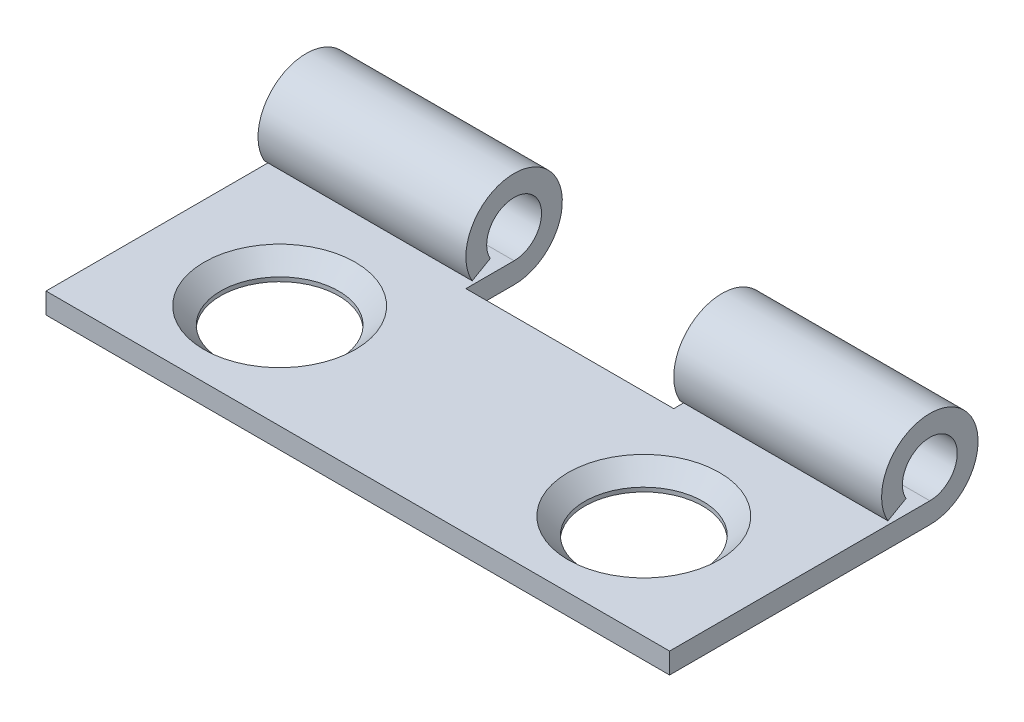
ISO-10303-21;
HEADER;
FILE_DESCRIPTION(('STEP AP214'),'2;1');
FILE_NAME('part.step','',(''),(''),'','','');
FILE_SCHEMA(('AUTOMOTIVE_DESIGN { 1 0 10303 214 1 1 1 1 }'));
ENDSEC;
DATA;
#1=APPLICATION_CONTEXT('core data for automotive mechanical design processes');
#2=APPLICATION_PROTOCOL_DEFINITION('international standard','automotive_design',2000,#1);
#3=PRODUCT_CONTEXT('',#1,'mechanical');
#4=PRODUCT('Part','Part','',(#3));
#5=PRODUCT_RELATED_PRODUCT_CATEGORY('part','',(#4));
#6=PRODUCT_DEFINITION_FORMATION('','',#4);
#7=PRODUCT_DEFINITION_CONTEXT('part definition',#1,'design');
#8=PRODUCT_DEFINITION('design','',#6,#7);
#9=PRODUCT_DEFINITION_SHAPE('','',#8);
#10=(LENGTH_UNIT() NAMED_UNIT(*) SI_UNIT(.MILLI.,.METRE.));
#11=(NAMED_UNIT(*) PLANE_ANGLE_UNIT() SI_UNIT($,.RADIAN.));
#12=(NAMED_UNIT(*) SI_UNIT($,.STERADIAN.) SOLID_ANGLE_UNIT());
#13=UNCERTAINTY_MEASURE_WITH_UNIT(LENGTH_MEASURE(1.E-05),#10,'distance_accuracy_value','');
#14=(GEOMETRIC_REPRESENTATION_CONTEXT(3) GLOBAL_UNCERTAINTY_ASSIGNED_CONTEXT((#13)) GLOBAL_UNIT_ASSIGNED_CONTEXT((#10,
#11,#12)) REPRESENTATION_CONTEXT('',''));
#15=CARTESIAN_POINT('',(0.,0.,0.));
#16=DIRECTION('',(0.,0.,1.));
#17=DIRECTION('',(1.,0.,0.));
#18=AXIS2_PLACEMENT_3D('',#15,#16,#17);
#19=CARTESIAN_POINT('',(9.525,0.,0.));
#20=DIRECTION('',(-1.,0.,0.));
#21=DIRECTION('',(0.,0.,1.));
#22=AXIS2_PLACEMENT_3D('',#19,#20,#21);
#23=CYLINDRICAL_SURFACE('',#22,0.8382);
#24=DIRECTION('',(-1.,0.,0.));
#25=VECTOR('',#24,1.);
#26=CARTESIAN_POINT('',(9.525,-0.414510225725591,0.728533124002553));
#27=LINE('',#26,#25);
#28=CARTESIAN_POINT('',(9.525,-0.414510225725591,0.728533124002553));
#29=VERTEX_POINT('',#28);
#30=CARTESIAN_POINT('',(3.175,-0.414510225725591,0.728533124002553));
#31=VERTEX_POINT('',#30);
#32=EDGE_CURVE('E156',#29,#31,#27,.T.);
#33=ORIENTED_EDGE('',*,*,#32,.T.);
#34=CARTESIAN_POINT('',(3.175,0.,0.));
#35=DIRECTION('',(1.,0.,0.));
#36=DIRECTION('',(0.,0.,-1.));
#37=AXIS2_PLACEMENT_3D('',#34,#35,#36);
#38=CIRCLE('',#37,0.8382);
#39=CARTESIAN_POINT('',(3.175,-0.8382,0.));
#40=VERTEX_POINT('',#39);
#41=EDGE_CURVE('E206',#31,#40,#38,.F.);
#42=ORIENTED_EDGE('',*,*,#41,.T.);
#43=DIRECTION('',(-1.,0.,0.));
#44=VECTOR('',#43,1.);
#45=CARTESIAN_POINT('',(9.525,-0.8382,0.));
#46=LINE('',#45,#44);
#47=CARTESIAN_POINT('',(9.525,-0.8382,0.));
#48=VERTEX_POINT('',#47);
#49=EDGE_CURVE('E166',#48,#40,#46,.T.);
#50=ORIENTED_EDGE('',*,*,#49,.F.);
#51=CARTESIAN_POINT('',(9.525,0.,0.));
#52=DIRECTION('',(-1.,0.,0.));
#53=DIRECTION('',(0.,0.,1.));
#54=AXIS2_PLACEMENT_3D('',#51,#52,#53);
#55=CIRCLE('',#54,0.8382);
#56=EDGE_CURVE('E155',#29,#48,#55,.T.);
#57=ORIENTED_EDGE('',*,*,#56,.F.);
#58=EDGE_LOOP('',(#33,#42,#50,#57));
#59=FACE_BOUND('',#58,.T.);
#60=ADVANCED_FACE('F36',(#59),#23,.F.);
#61=CARTESIAN_POINT('',(9.525,0.,0.));
#62=DIRECTION('',(-1.,0.,0.));
#63=DIRECTION('',(0.,0.,1.));
#64=AXIS2_PLACEMENT_3D('',#61,#62,#63);
#65=CYLINDRICAL_SURFACE('',#64,1.47320000000008);
#66=CARTESIAN_POINT('',(3.175,0.,0.));
#67=DIRECTION('',(1.,0.,0.));
#68=DIRECTION('',(0.,0.,-1.));
#69=AXIS2_PLACEMENT_3D('',#66,#67,#68);
#70=CIRCLE('',#69,1.47320000000008);
#71=CARTESIAN_POINT('',(3.175,-1.4732,0.));
#72=VERTEX_POINT('',#71);
#73=CARTESIAN_POINT('',(3.175,-0.728533124002552,1.28045215733782));
#74=VERTEX_POINT('',#73);
#75=EDGE_CURVE('E207',#72,#74,#70,.T.);
#76=ORIENTED_EDGE('',*,*,#75,.T.);
#77=DIRECTION('',(-1.,0.,0.));
#78=VECTOR('',#77,1.);
#79=CARTESIAN_POINT('',(9.525,-0.728533124002553,1.28045215733782));
#80=LINE('',#79,#78);
#81=CARTESIAN_POINT('',(9.525,-0.728533124002553,1.28045215733782));
#82=VERTEX_POINT('',#81);
#83=EDGE_CURVE('E135',#82,#74,#80,.T.);
#84=ORIENTED_EDGE('',*,*,#83,.F.);
#85=CARTESIAN_POINT('',(9.525,0.,0.));
#86=DIRECTION('',(1.,0.,0.));
#87=DIRECTION('',(0.,0.,1.));
#88=AXIS2_PLACEMENT_3D('',#85,#86,#87);
#89=CIRCLE('',#88,1.47320000000008);
#90=CARTESIAN_POINT('',(9.525,-1.4732,0.));
#91=VERTEX_POINT('',#90);
#92=EDGE_CURVE('E112',#91,#82,#89,.T.);
#93=ORIENTED_EDGE('',*,*,#92,.F.);
#94=DIRECTION('',(-1.,0.,0.));
#95=VECTOR('',#94,1.);
#96=CARTESIAN_POINT('',(9.525,-1.4732,0.));
#97=LINE('',#96,#95);
#98=EDGE_CURVE('E122',#91,#72,#97,.T.);
#99=ORIENTED_EDGE('',*,*,#98,.T.);
#100=EDGE_LOOP('',(#76,#84,#93,#99));
#101=FACE_BOUND('',#100,.T.);
#102=ADVANCED_FACE('F133',(#101),#65,.T.);
#103=CARTESIAN_POINT('',(9.525,-0.414510225725591,0.728533124002553));
#104=DIRECTION('',(0.,0.869163832024043,0.49452424925506));
#105=DIRECTION('',(0.,-0.49452424925506,0.869163832024043));
#106=AXIS2_PLACEMENT_3D('',#103,#104,#105);
#107=PLANE('',#106);
#108=ORIENTED_EDGE('',*,*,#83,.T.);
#109=DIRECTION('',(0.,0.49452424925506,-0.869163832024043));
#110=VECTOR('',#109,1.);
#111=CARTESIAN_POINT('',(3.175,-0.414510225725591,0.728533124002554));
#112=LINE('',#111,#110);
#113=EDGE_CURVE('E11',#74,#31,#112,.T.);
#114=ORIENTED_EDGE('',*,*,#113,.T.);
#115=ORIENTED_EDGE('',*,*,#32,.F.);
#116=DIRECTION('',(0.,0.49452424925506,-0.869163832024043));
#117=VECTOR('',#116,1.);
#118=CARTESIAN_POINT('',(9.525,-0.414510225725591,0.728533124002553));
#119=LINE('',#118,#117);
#120=EDGE_CURVE('E62',#82,#29,#119,.T.);
#121=ORIENTED_EDGE('',*,*,#120,.F.);
#122=EDGE_LOOP('',(#108,#114,#115,#121));
#123=FACE_BOUND('',#122,.T.);
#124=ADVANCED_FACE('F263',(#123),#107,.F.);
#125=CARTESIAN_POINT('',(-3.175,-0.8382,0.));
#126=VERTEX_POINT('',#125);
#127=CARTESIAN_POINT('',(-9.525,-0.8382,0.));
#128=VERTEX_POINT('',#127);
#129=EDGE_CURVE('E165',#126,#128,#46,.T.);
#130=ORIENTED_EDGE('',*,*,#129,.F.);
#131=CARTESIAN_POINT('',(-3.175,0.,0.));
#132=DIRECTION('',(-1.,0.,0.));
#133=DIRECTION('',(0.,0.,1.));
#134=AXIS2_PLACEMENT_3D('',#131,#132,#133);
#135=CIRCLE('',#134,0.8382);
#136=CARTESIAN_POINT('',(-3.175,-0.414510225725591,0.728533124002553));
#137=VERTEX_POINT('',#136);
#138=EDGE_CURVE('E198',#126,#137,#135,.F.);
#139=ORIENTED_EDGE('',*,*,#138,.T.);
#140=CARTESIAN_POINT('',(-9.525,-0.414510225725591,0.728533124002553));
#141=VERTEX_POINT('',#140);
#142=EDGE_CURVE('E90',#137,#141,#27,.T.);
#143=ORIENTED_EDGE('',*,*,#142,.T.);
#144=CARTESIAN_POINT('',(-9.525,0.,0.));
#145=DIRECTION('',(-1.,0.,0.));
#146=DIRECTION('',(0.,0.,1.));
#147=AXIS2_PLACEMENT_3D('',#144,#145,#146);
#148=CIRCLE('',#147,0.8382);
#149=EDGE_CURVE('E140',#141,#128,#148,.T.);
#150=ORIENTED_EDGE('',*,*,#149,.T.);
#151=EDGE_LOOP('',(#130,#139,#143,#150));
#152=FACE_BOUND('',#151,.T.);
#153=ADVANCED_FACE('F38',(#152),#23,.F.);
#154=CARTESIAN_POINT('',(9.525,-0.8382,7.9502));
#155=DIRECTION('',(0.,-1.,0.));
#156=DIRECTION('',(0.,0.,-1.));
#157=AXIS2_PLACEMENT_3D('',#154,#155,#156);
#158=PLANE('',#157);
#159=CARTESIAN_POINT('',(5.5626,-0.8382,4.7752));
#160=DIRECTION('',(0.,1.,0.));
#161=DIRECTION('',(0.,0.,1.));
#162=AXIS2_PLACEMENT_3D('',#159,#160,#161);
#163=CIRCLE('',#162,2.3114);
#164=CARTESIAN_POINT('',(5.5626,-0.8382,7.0866));
#165=VERTEX_POINT('',#164);
#166=EDGE_CURVE('E183',#165,#165,#163,.T.);
#167=ORIENTED_EDGE('',*,*,#166,.F.);
#168=EDGE_LOOP('',(#167));
#169=FACE_BOUND('',#168,.T.);
#170=CARTESIAN_POINT('',(-5.5626,-0.8382,4.7752));
#171=DIRECTION('',(0.,1.,0.));
#172=DIRECTION('',(0.,0.,1.));
#173=AXIS2_PLACEMENT_3D('',#170,#171,#172);
#174=CIRCLE('',#173,2.3114);
#175=CARTESIAN_POINT('',(-5.5626,-0.8382,7.0866));
#176=VERTEX_POINT('',#175);
#177=EDGE_CURVE('E174',#176,#176,#174,.T.);
#178=ORIENTED_EDGE('',*,*,#177,.F.);
#179=EDGE_LOOP('',(#178));
#180=FACE_BOUND('',#179,.T.);
#181=ORIENTED_EDGE('',*,*,#49,.T.);
#182=DIRECTION('',(0.,0.,1.));
#183=VECTOR('',#182,1.);
#184=CARTESIAN_POINT('',(3.175,-0.8382,7.9502));
#185=LINE('',#184,#183);
#186=CARTESIAN_POINT('',(3.175,-0.8382,1.47320000000012));
#187=VERTEX_POINT('',#186);
#188=EDGE_CURVE('E209',#40,#187,#185,.T.);
#189=ORIENTED_EDGE('',*,*,#188,.T.);
#190=DIRECTION('',(-1.,0.,0.));
#191=VECTOR('',#190,1.);
#192=CARTESIAN_POINT('',(9.525,-0.8382,1.47320000000012));
#193=LINE('',#192,#191);
#194=CARTESIAN_POINT('',(-3.175,-0.8382,1.47320000000012));
#195=VERTEX_POINT('',#194);
#196=EDGE_CURVE('E143',#187,#195,#193,.T.);
#197=ORIENTED_EDGE('',*,*,#196,.T.);
#198=DIRECTION('',(0.,0.,-1.));
#199=VECTOR('',#198,1.);
#200=CARTESIAN_POINT('',(-3.175,-0.8382,7.9502));
#201=LINE('',#200,#199);
#202=EDGE_CURVE('E202',#195,#126,#201,.T.);
#203=ORIENTED_EDGE('',*,*,#202,.T.);
#204=ORIENTED_EDGE('',*,*,#129,.T.);
#205=DIRECTION('',(0.,0.,1.));
#206=VECTOR('',#205,1.);
#207=CARTESIAN_POINT('',(-9.525,-0.8382,7.9502));
#208=LINE('',#207,#206);
#209=CARTESIAN_POINT('',(-9.525,-0.8382,7.9502));
#210=VERTEX_POINT('',#209);
#211=EDGE_CURVE('E142',#128,#210,#208,.T.);
#212=ORIENTED_EDGE('',*,*,#211,.T.);
#213=DIRECTION('',(-1.,0.,0.));
#214=VECTOR('',#213,1.);
#215=CARTESIAN_POINT('',(9.525,-0.8382,7.9502));
#216=LINE('',#215,#214);
#217=CARTESIAN_POINT('',(9.525,-0.8382,7.9502));
#218=VERTEX_POINT('',#217);
#219=EDGE_CURVE('E162',#218,#210,#216,.T.);
#220=ORIENTED_EDGE('',*,*,#219,.F.);
#221=DIRECTION('',(0.,0.,1.));
#222=VECTOR('',#221,1.);
#223=CARTESIAN_POINT('',(9.525,-0.8382,7.9502));
#224=LINE('',#223,#222);
#225=EDGE_CURVE('E99',#48,#218,#224,.T.);
#226=ORIENTED_EDGE('',*,*,#225,.F.);
#227=EDGE_LOOP('',(#181,#189,#197,#203,#204,#212,#220,#226));
#228=FACE_BOUND('',#227,.T.);
#229=ADVANCED_FACE('F219',(#169,#180,#228),#158,.F.);
#230=CARTESIAN_POINT('',(9.525,-1.4732,7.9502));
#231=DIRECTION('',(0.,0.,-1.));
#232=DIRECTION('',(-1.,0.,0.));
#233=AXIS2_PLACEMENT_3D('',#230,#231,#232);
#234=PLANE('',#233);
#235=DIRECTION('',(0.,-1.,0.));
#236=VECTOR('',#235,1.);
#237=CARTESIAN_POINT('',(-9.525,-1.4732,7.9502));
#238=LINE('',#237,#236);
#239=CARTESIAN_POINT('',(-9.525,-1.4732,7.9502));
#240=VERTEX_POINT('',#239);
#241=EDGE_CURVE('E145',#210,#240,#238,.T.);
#242=ORIENTED_EDGE('',*,*,#241,.T.);
#243=DIRECTION('',(-1.,0.,0.));
#244=VECTOR('',#243,1.);
#245=CARTESIAN_POINT('',(9.525,-1.4732,7.9502));
#246=LINE('',#245,#244);
#247=CARTESIAN_POINT('',(9.525,-1.4732,7.9502));
#248=VERTEX_POINT('',#247);
#249=EDGE_CURVE('E130',#248,#240,#246,.T.);
#250=ORIENTED_EDGE('',*,*,#249,.F.);
#251=DIRECTION('',(0.,-1.,0.));
#252=VECTOR('',#251,1.);
#253=CARTESIAN_POINT('',(9.525,-1.4732,7.9502));
#254=LINE('',#253,#252);
#255=EDGE_CURVE('E115',#218,#248,#254,.T.);
#256=ORIENTED_EDGE('',*,*,#255,.F.);
#257=ORIENTED_EDGE('',*,*,#219,.T.);
#258=EDGE_LOOP('',(#242,#250,#256,#257));
#259=FACE_BOUND('',#258,.T.);
#260=ADVANCED_FACE('F223',(#259),#234,.F.);
#261=CARTESIAN_POINT('',(9.525,-1.4732,0.));
#262=DIRECTION('',(0.,1.,0.));
#263=DIRECTION('',(0.,0.,1.));
#264=AXIS2_PLACEMENT_3D('',#261,#262,#263);
#265=PLANE('',#264);
#266=CARTESIAN_POINT('',(5.5626,-1.4732,4.7752));
#267=DIRECTION('',(0.,1.,0.));
#268=DIRECTION('',(0.,0.,1.));
#269=AXIS2_PLACEMENT_3D('',#266,#267,#268);
#270=CIRCLE('',#269,1.8034);
#271=CARTESIAN_POINT('',(5.5626,-1.4732,6.5786));
#272=VERTEX_POINT('',#271);
#273=EDGE_CURVE('E170',#272,#272,#270,.T.);
#274=ORIENTED_EDGE('',*,*,#273,.T.);
#275=EDGE_LOOP('',(#274));
#276=FACE_BOUND('',#275,.T.);
#277=CARTESIAN_POINT('',(-5.5626,-1.4732,4.7752));
#278=DIRECTION('',(0.,1.,0.));
#279=DIRECTION('',(0.,0.,1.));
#280=AXIS2_PLACEMENT_3D('',#277,#278,#279);
#281=CIRCLE('',#280,1.8034);
#282=CARTESIAN_POINT('',(-5.5626,-1.4732,6.5786));
#283=VERTEX_POINT('',#282);
#284=EDGE_CURVE('E176',#283,#283,#281,.T.);
#285=ORIENTED_EDGE('',*,*,#284,.T.);
#286=EDGE_LOOP('',(#285));
#287=FACE_BOUND('',#286,.T.);
#288=DIRECTION('',(1.,0.,0.));
#289=VECTOR('',#288,1.);
#290=CARTESIAN_POINT('',(3.175,-1.4732,1.47320000000012));
#291=LINE('',#290,#289);
#292=CARTESIAN_POINT('',(-3.175,-1.4732,1.47320000000012));
#293=VERTEX_POINT('',#292);
#294=CARTESIAN_POINT('',(3.175,-1.4732,1.47320000000012));
#295=VERTEX_POINT('',#294);
#296=EDGE_CURVE('E192',#293,#295,#291,.T.);
#297=ORIENTED_EDGE('',*,*,#296,.T.);
#298=DIRECTION('',(0.,0.,-1.));
#299=VECTOR('',#298,1.);
#300=CARTESIAN_POINT('',(3.175,-1.4732,-1.47320000000013));
#301=LINE('',#300,#299);
#302=EDGE_CURVE('E127',#295,#72,#301,.T.);
#303=ORIENTED_EDGE('',*,*,#302,.T.);
#304=ORIENTED_EDGE('',*,*,#98,.F.);
#305=DIRECTION('',(0.,0.,-1.));
#306=VECTOR('',#305,1.);
#307=CARTESIAN_POINT('',(9.525,-1.4732,0.));
#308=LINE('',#307,#306);
#309=EDGE_CURVE('E108',#248,#91,#308,.T.);
#310=ORIENTED_EDGE('',*,*,#309,.F.);
#311=ORIENTED_EDGE('',*,*,#249,.T.);
#312=DIRECTION('',(0.,0.,-1.));
#313=VECTOR('',#312,1.);
#314=CARTESIAN_POINT('',(-9.525,-1.4732,0.));
#315=LINE('',#314,#313);
#316=CARTESIAN_POINT('',(-9.525,-1.4732,0.));
#317=VERTEX_POINT('',#316);
#318=EDGE_CURVE('E147',#240,#317,#315,.T.);
#319=ORIENTED_EDGE('',*,*,#318,.T.);
#320=CARTESIAN_POINT('',(-3.175,-1.4732,0.));
#321=VERTEX_POINT('',#320);
#322=EDGE_CURVE('E131',#321,#317,#97,.T.);
#323=ORIENTED_EDGE('',*,*,#322,.F.);
#324=DIRECTION('',(0.,0.,1.));
#325=VECTOR('',#324,1.);
#326=CARTESIAN_POINT('',(-3.175,-1.4732,1.47320000000012));
#327=LINE('',#326,#325);
#328=EDGE_CURVE('E189',#321,#293,#327,.T.);
#329=ORIENTED_EDGE('',*,*,#328,.T.);
#330=EDGE_LOOP('',(#297,#303,#304,#310,#311,#319,#323,#329));
#331=FACE_BOUND('',#330,.T.);
#332=ADVANCED_FACE('F124',(#276,#287,#331),#265,.F.);
#333=CARTESIAN_POINT('',(-3.175,-0.728533124002553,1.28045215733782));
#334=VERTEX_POINT('',#333);
#335=CARTESIAN_POINT('',(-9.525,-0.728533124002553,1.28045215733782));
#336=VERTEX_POINT('',#335);
#337=EDGE_CURVE('E159',#334,#336,#80,.T.);
#338=ORIENTED_EDGE('',*,*,#337,.F.);
#339=CARTESIAN_POINT('',(-3.175,0.,0.));
#340=DIRECTION('',(-1.,0.,0.));
#341=DIRECTION('',(0.,0.,1.));
#342=AXIS2_PLACEMENT_3D('',#339,#340,#341);
#343=CIRCLE('',#342,1.47320000000008);
#344=EDGE_CURVE('E53',#334,#321,#343,.T.);
#345=ORIENTED_EDGE('',*,*,#344,.T.);
#346=ORIENTED_EDGE('',*,*,#322,.T.);
#347=CARTESIAN_POINT('',(-9.525,0.,0.));
#348=DIRECTION('',(1.,0.,0.));
#349=DIRECTION('',(0.,0.,1.));
#350=AXIS2_PLACEMENT_3D('',#347,#348,#349);
#351=CIRCLE('',#350,1.47320000000008);
#352=EDGE_CURVE('E150',#317,#336,#351,.T.);
#353=ORIENTED_EDGE('',*,*,#352,.T.);
#354=EDGE_LOOP('',(#338,#345,#346,#353));
#355=FACE_BOUND('',#354,.T.);
#356=ADVANCED_FACE('F233',(#355),#65,.T.);
#357=ORIENTED_EDGE('',*,*,#142,.F.);
#358=DIRECTION('',(0.,-0.49452424925506,0.869163832024043));
#359=VECTOR('',#358,1.);
#360=CARTESIAN_POINT('',(-3.175,-0.414510225725592,0.728533124002554));
#361=LINE('',#360,#359);
#362=EDGE_CURVE('E45',#137,#334,#361,.T.);
#363=ORIENTED_EDGE('',*,*,#362,.T.);
#364=ORIENTED_EDGE('',*,*,#337,.T.);
#365=DIRECTION('',(0.,0.49452424925506,-0.869163832024043));
#366=VECTOR('',#365,1.);
#367=CARTESIAN_POINT('',(-9.525,-0.414510225725591,0.728533124002553));
#368=LINE('',#367,#366);
#369=EDGE_CURVE('E153',#336,#141,#368,.T.);
#370=ORIENTED_EDGE('',*,*,#369,.T.);
#371=EDGE_LOOP('',(#357,#363,#364,#370));
#372=FACE_BOUND('',#371,.T.);
#373=ADVANCED_FACE('F272',(#372),#107,.F.);
#374=CARTESIAN_POINT('',(9.525,0.,0.));
#375=DIRECTION('',(-1.,0.,0.));
#376=DIRECTION('',(0.,0.,1.));
#377=AXIS2_PLACEMENT_3D('',#374,#375,#376);
#378=PLANE('',#377);
#379=ORIENTED_EDGE('',*,*,#56,.T.);
#380=ORIENTED_EDGE('',*,*,#225,.T.);
#381=ORIENTED_EDGE('',*,*,#255,.T.);
#382=ORIENTED_EDGE('',*,*,#309,.T.);
#383=ORIENTED_EDGE('',*,*,#92,.T.);
#384=ORIENTED_EDGE('',*,*,#120,.T.);
#385=EDGE_LOOP('',(#379,#380,#381,#382,#383,#384));
#386=FACE_BOUND('',#385,.T.);
#387=ADVANCED_FACE('F110',(#386),#378,.F.);
#388=CARTESIAN_POINT('',(-9.525,0.,0.));
#389=DIRECTION('',(-1.,0.,0.));
#390=DIRECTION('',(0.,0.,1.));
#391=AXIS2_PLACEMENT_3D('',#388,#389,#390);
#392=PLANE('',#391);
#393=ORIENTED_EDGE('',*,*,#149,.F.);
#394=ORIENTED_EDGE('',*,*,#369,.F.);
#395=ORIENTED_EDGE('',*,*,#352,.F.);
#396=ORIENTED_EDGE('',*,*,#318,.F.);
#397=ORIENTED_EDGE('',*,*,#241,.F.);
#398=ORIENTED_EDGE('',*,*,#211,.F.);
#399=EDGE_LOOP('',(#393,#394,#395,#396,#397,#398));
#400=FACE_BOUND('',#399,.T.);
#401=ADVANCED_FACE('F229',(#400),#392,.T.);
#402=CARTESIAN_POINT('',(3.175,-1.4732,1.47320000000012));
#403=DIRECTION('',(0.,0.,1.));
#404=DIRECTION('',(1.,0.,0.));
#405=AXIS2_PLACEMENT_3D('',#402,#403,#404);
#406=PLANE('',#405);
#407=DIRECTION('',(0.,1.,0.));
#408=VECTOR('',#407,1.);
#409=CARTESIAN_POINT('',(3.175,-1.4732,1.47320000000012));
#410=LINE('',#409,#408);
#411=EDGE_CURVE('E195',#295,#187,#410,.T.);
#412=ORIENTED_EDGE('',*,*,#411,.F.);
#413=ORIENTED_EDGE('',*,*,#296,.F.);
#414=DIRECTION('',(0.,1.,0.));
#415=VECTOR('',#414,1.);
#416=CARTESIAN_POINT('',(-3.175,-1.4732,1.47320000000012));
#417=LINE('',#416,#415);
#418=EDGE_CURVE('E194',#293,#195,#417,.T.);
#419=ORIENTED_EDGE('',*,*,#418,.T.);
#420=ORIENTED_EDGE('',*,*,#196,.F.);
#421=EDGE_LOOP('',(#412,#413,#419,#420));
#422=FACE_BOUND('',#421,.T.);
#423=ADVANCED_FACE('F266',(#422),#406,.F.);
#424=CARTESIAN_POINT('',(3.175,-1.4732,-1.47320000000013));
#425=DIRECTION('',(1.,0.,0.));
#426=DIRECTION('',(0.,0.,-1.));
#427=AXIS2_PLACEMENT_3D('',#424,#425,#426);
#428=PLANE('',#427);
#429=ORIENTED_EDGE('',*,*,#41,.F.);
#430=ORIENTED_EDGE('',*,*,#113,.F.);
#431=ORIENTED_EDGE('',*,*,#75,.F.);
#432=ORIENTED_EDGE('',*,*,#302,.F.);
#433=ORIENTED_EDGE('',*,*,#411,.T.);
#434=ORIENTED_EDGE('',*,*,#188,.F.);
#435=EDGE_LOOP('',(#429,#430,#431,#432,#433,#434));
#436=FACE_BOUND('',#435,.T.);
#437=ADVANCED_FACE('F259',(#436),#428,.F.);
#438=CARTESIAN_POINT('',(-3.175,-1.4732,1.47320000000012));
#439=DIRECTION('',(-1.,0.,0.));
#440=DIRECTION('',(0.,0.,1.));
#441=AXIS2_PLACEMENT_3D('',#438,#439,#440);
#442=PLANE('',#441);
#443=ORIENTED_EDGE('',*,*,#344,.F.);
#444=ORIENTED_EDGE('',*,*,#362,.F.);
#445=ORIENTED_EDGE('',*,*,#138,.F.);
#446=ORIENTED_EDGE('',*,*,#202,.F.);
#447=ORIENTED_EDGE('',*,*,#418,.F.);
#448=ORIENTED_EDGE('',*,*,#328,.F.);
#449=EDGE_LOOP('',(#443,#444,#445,#446,#447,#448));
#450=FACE_BOUND('',#449,.T.);
#451=ADVANCED_FACE('F269',(#450),#442,.F.);
#452=CARTESIAN_POINT('',(-5.5626,-0.8382,4.7752));
#453=DIRECTION('',(0.,1.,0.));
#454=DIRECTION('',(0.,0.,1.));
#455=AXIS2_PLACEMENT_3D('',#452,#453,#454);
#456=CONICAL_SURFACE('',#455,2.3114,0.78539816339745);
#457=CARTESIAN_POINT('',(-5.5626,-1.3462,4.7752));
#458=DIRECTION('',(0.,1.,0.));
#459=DIRECTION('',(0.,0.,1.));
#460=AXIS2_PLACEMENT_3D('',#457,#458,#459);
#461=CIRCLE('',#460,1.8034);
#462=CARTESIAN_POINT('',(-5.5626,-1.3462,6.5786));
#463=VERTEX_POINT('',#462);
#464=EDGE_CURVE('E40',#463,#463,#461,.F.);
#465=ORIENTED_EDGE('',*,*,#464,.T.);
#466=EDGE_LOOP('',(#465));
#467=FACE_BOUND('',#466,.T.);
#468=ORIENTED_EDGE('',*,*,#177,.T.);
#469=EDGE_LOOP('',(#468));
#470=FACE_BOUND('',#469,.T.);
#471=ADVANCED_FACE('F312',(#467,#470),#456,.F.);
#472=CARTESIAN_POINT('',(5.5626,-0.8382,4.7752));
#473=DIRECTION('',(0.,1.,0.));
#474=DIRECTION('',(0.,0.,1.));
#475=AXIS2_PLACEMENT_3D('',#472,#473,#474);
#476=CONICAL_SURFACE('',#475,2.3114,0.78539816339745);
#477=CARTESIAN_POINT('',(5.5626,-1.3462,4.7752));
#478=DIRECTION('',(0.,1.,0.));
#479=DIRECTION('',(0.,0.,1.));
#480=AXIS2_PLACEMENT_3D('',#477,#478,#479);
#481=CIRCLE('',#480,1.8034);
#482=CARTESIAN_POINT('',(5.5626,-1.3462,6.5786));
#483=VERTEX_POINT('',#482);
#484=EDGE_CURVE('E168',#483,#483,#481,.F.);
#485=ORIENTED_EDGE('',*,*,#484,.T.);
#486=EDGE_LOOP('',(#485));
#487=FACE_BOUND('',#486,.T.);
#488=ORIENTED_EDGE('',*,*,#166,.T.);
#489=EDGE_LOOP('',(#488));
#490=FACE_BOUND('',#489,.T.);
#491=ADVANCED_FACE('F315',(#487,#490),#476,.F.);
#492=CARTESIAN_POINT('',(5.5626,-1.4732,4.7752));
#493=DIRECTION('',(0.,1.,0.));
#494=DIRECTION('',(0.,0.,1.));
#495=AXIS2_PLACEMENT_3D('',#492,#493,#494);
#496=CYLINDRICAL_SURFACE('',#495,1.8034);
#497=ORIENTED_EDGE('',*,*,#273,.F.);
#498=EDGE_LOOP('',(#497));
#499=FACE_BOUND('',#498,.T.);
#500=ORIENTED_EDGE('',*,*,#484,.F.);
#501=EDGE_LOOP('',(#500));
#502=FACE_BOUND('',#501,.T.);
#503=ADVANCED_FACE('F308',(#499,#502),#496,.F.);
#504=CARTESIAN_POINT('',(-5.5626,-1.4732,4.7752));
#505=DIRECTION('',(0.,1.,0.));
#506=DIRECTION('',(0.,0.,1.));
#507=AXIS2_PLACEMENT_3D('',#504,#505,#506);
#508=CYLINDRICAL_SURFACE('',#507,1.8034);
#509=ORIENTED_EDGE('',*,*,#284,.F.);
#510=EDGE_LOOP('',(#509));
#511=FACE_BOUND('',#510,.T.);
#512=ORIENTED_EDGE('',*,*,#464,.F.);
#513=EDGE_LOOP('',(#512));
#514=FACE_BOUND('',#513,.T.);
#515=ADVANCED_FACE('F305',(#511,#514),#508,.F.);
#516=CLOSED_SHELL('',(#60,#102,#124,#153,#229,#260,#332,#356,#373,#387,#401,#423,#437,#451,#471,
#491,#503,#515));
#517=MANIFOLD_SOLID_BREP('B2',#516);
#518=ADVANCED_BREP_SHAPE_REPRESENTATION('',(#18,#517),#14);
#519=SHAPE_DEFINITION_REPRESENTATION(#9,#518);
ENDSEC;
END-ISO-10303-21;
